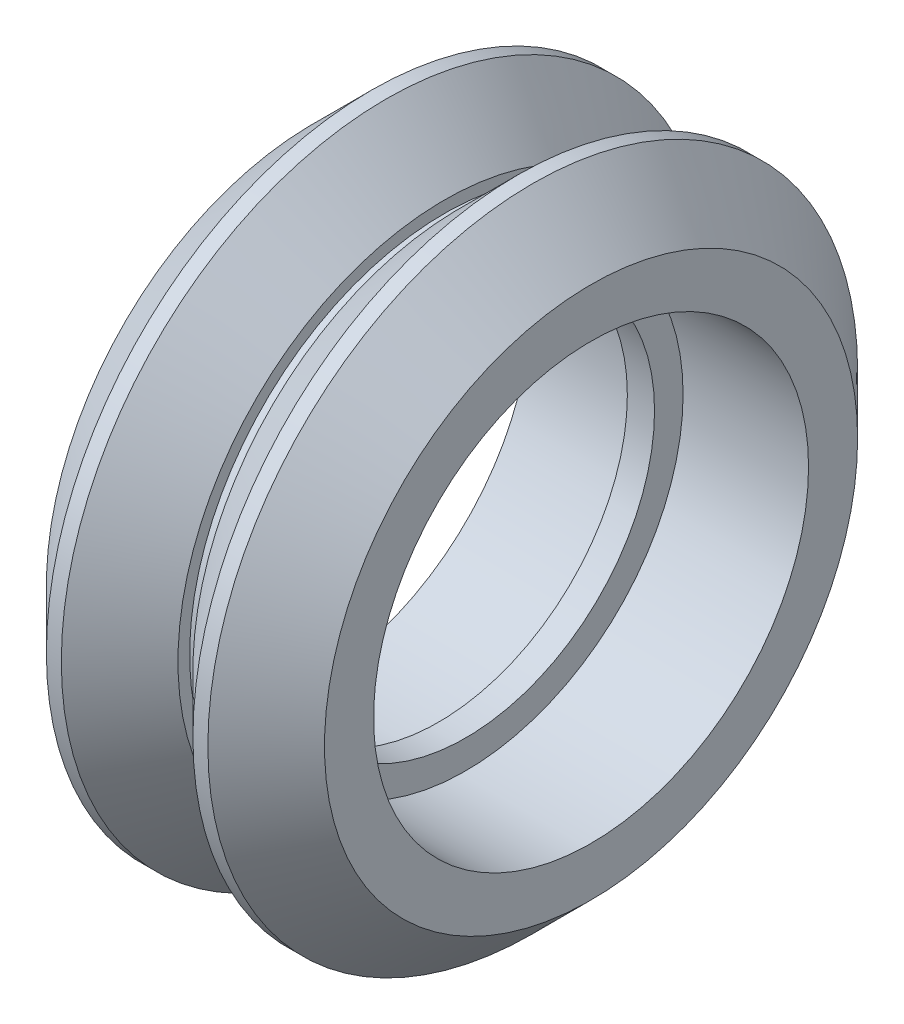
ISO-10303-21;
HEADER;
FILE_DESCRIPTION(('STEP AP214'),'2;1');
FILE_NAME('part.step','',(''),(''),'','','');
FILE_SCHEMA(('AUTOMOTIVE_DESIGN { 1 0 10303 214 1 1 1 1 }'));
ENDSEC;
DATA;
#1=APPLICATION_CONTEXT('core data for automotive mechanical design processes');
#2=APPLICATION_PROTOCOL_DEFINITION('international standard','automotive_design',2000,#1);
#3=PRODUCT_CONTEXT('',#1,'mechanical');
#4=PRODUCT('Part','Part','',(#3));
#5=PRODUCT_RELATED_PRODUCT_CATEGORY('part','',(#4));
#6=PRODUCT_DEFINITION_FORMATION('','',#4);
#7=PRODUCT_DEFINITION_CONTEXT('part definition',#1,'design');
#8=PRODUCT_DEFINITION('design','',#6,#7);
#9=PRODUCT_DEFINITION_SHAPE('','',#8);
#10=(LENGTH_UNIT() NAMED_UNIT(*) SI_UNIT(.MILLI.,.METRE.));
#11=(NAMED_UNIT(*) PLANE_ANGLE_UNIT() SI_UNIT($,.RADIAN.));
#12=(NAMED_UNIT(*) SI_UNIT($,.STERADIAN.) SOLID_ANGLE_UNIT());
#13=UNCERTAINTY_MEASURE_WITH_UNIT(LENGTH_MEASURE(1.E-05),#10,'distance_accuracy_value','');
#14=(GEOMETRIC_REPRESENTATION_CONTEXT(3) GLOBAL_UNCERTAINTY_ASSIGNED_CONTEXT((#13)) GLOBAL_UNIT_ASSIGNED_CONTEXT((#10,
#11,#12)) REPRESENTATION_CONTEXT('',''));
#15=CARTESIAN_POINT('',(0.,0.,0.));
#16=DIRECTION('',(0.,0.,1.));
#17=DIRECTION('',(1.,0.,0.));
#18=AXIS2_PLACEMENT_3D('',#15,#16,#17);
#19=CARTESIAN_POINT('',(-0.499999999999999,6.95,0.));
#20=DIRECTION('',(-1.,0.,0.));
#21=DIRECTION('',(0.,0.,1.));
#22=AXIS2_PLACEMENT_3D('',#19,#20,#21);
#23=PLANE('',#22);
#24=CARTESIAN_POINT('',(-0.499999999999999,0.,0.));
#25=DIRECTION('',(1.,0.,0.));
#26=DIRECTION('',(0.,0.,-1.));
#27=AXIS2_PLACEMENT_3D('',#24,#25,#26);
#28=CIRCLE('',#27,6.95);
#29=CARTESIAN_POINT('',(-0.499999999999999,0.,-6.95));
#30=VERTEX_POINT('',#29);
#31=EDGE_CURVE('E10',#30,#30,#28,.T.);
#32=ORIENTED_EDGE('',*,*,#31,.T.);
#33=EDGE_LOOP('',(#32));
#34=FACE_BOUND('',#33,.T.);
#35=CARTESIAN_POINT('',(-0.499999999999999,0.,0.));
#36=DIRECTION('',(1.,0.,0.));
#37=DIRECTION('',(0.,0.,-1.));
#38=AXIS2_PLACEMENT_3D('',#35,#36,#37);
#39=CIRCLE('',#38,8.);
#40=CARTESIAN_POINT('',(-0.499999999999999,0.,-8.));
#41=VERTEX_POINT('',#40);
#42=EDGE_CURVE('E85',#41,#41,#39,.T.);
#43=ORIENTED_EDGE('',*,*,#42,.F.);
#44=EDGE_LOOP('',(#43));
#45=FACE_BOUND('',#44,.T.);
#46=ADVANCED_FACE('F33',(#34,#45),#23,.T.);
#47=CARTESIAN_POINT('',(0.,0.,0.));
#48=DIRECTION('',(1.,0.,0.));
#49=DIRECTION('',(0.,0.,-1.));
#50=AXIS2_PLACEMENT_3D('',#47,#48,#49);
#51=CYLINDRICAL_SURFACE('',#50,6.95);
#52=CARTESIAN_POINT('',(0.500000000000001,0.,0.));
#53=DIRECTION('',(1.,0.,0.));
#54=DIRECTION('',(0.,0.,-1.));
#55=AXIS2_PLACEMENT_3D('',#52,#53,#54);
#56=CIRCLE('',#55,6.95);
#57=CARTESIAN_POINT('',(0.500000000000001,0.,-6.95));
#58=VERTEX_POINT('',#57);
#59=EDGE_CURVE('E39',#58,#58,#56,.T.);
#60=ORIENTED_EDGE('',*,*,#59,.T.);
#61=EDGE_LOOP('',(#60));
#62=FACE_BOUND('',#61,.T.);
#63=ORIENTED_EDGE('',*,*,#31,.F.);
#64=EDGE_LOOP('',(#63));
#65=FACE_BOUND('',#64,.T.);
#66=ADVANCED_FACE('F93',(#62,#65),#51,.F.);
#67=CARTESIAN_POINT('',(0.500000000000001,6.95,0.));
#68=DIRECTION('',(1.,0.,0.));
#69=DIRECTION('',(0.,0.,-1.));
#70=AXIS2_PLACEMENT_3D('',#67,#68,#69);
#71=PLANE('',#70);
#72=CARTESIAN_POINT('',(0.5,0.,0.));
#73=DIRECTION('',(1.,0.,0.));
#74=DIRECTION('',(0.,0.,-1.));
#75=AXIS2_PLACEMENT_3D('',#72,#73,#74);
#76=CIRCLE('',#75,8.);
#77=CARTESIAN_POINT('',(0.5,0.,-8.));
#78=VERTEX_POINT('',#77);
#79=EDGE_CURVE('E43',#78,#78,#76,.T.);
#80=ORIENTED_EDGE('',*,*,#79,.T.);
#81=EDGE_LOOP('',(#80));
#82=FACE_BOUND('',#81,.T.);
#83=ORIENTED_EDGE('',*,*,#59,.F.);
#84=EDGE_LOOP('',(#83));
#85=FACE_BOUND('',#84,.T.);
#86=ADVANCED_FACE('F97',(#82,#85),#71,.T.);
#87=CARTESIAN_POINT('',(0.,0.,0.));
#88=DIRECTION('',(1.,0.,0.));
#89=DIRECTION('',(0.,0.,-1.));
#90=AXIS2_PLACEMENT_3D('',#87,#88,#89);
#91=CYLINDRICAL_SURFACE('',#90,8.);
#92=CARTESIAN_POINT('',(5.115,0.,0.));
#93=DIRECTION('',(1.,0.,0.));
#94=DIRECTION('',(0.,0.,-1.));
#95=AXIS2_PLACEMENT_3D('',#92,#93,#94);
#96=CIRCLE('',#95,8.);
#97=CARTESIAN_POINT('',(5.115,0.,-8.));
#98=VERTEX_POINT('',#97);
#99=EDGE_CURVE('E47',#98,#98,#96,.T.);
#100=ORIENTED_EDGE('',*,*,#99,.T.);
#101=EDGE_LOOP('',(#100));
#102=FACE_BOUND('',#101,.T.);
#103=ORIENTED_EDGE('',*,*,#79,.F.);
#104=EDGE_LOOP('',(#103));
#105=FACE_BOUND('',#104,.T.);
#106=ADVANCED_FACE('F101',(#102,#105),#91,.F.);
#107=CARTESIAN_POINT('',(5.115,8.,0.));
#108=DIRECTION('',(1.,0.,0.));
#109=DIRECTION('',(0.,0.,-1.));
#110=AXIS2_PLACEMENT_3D('',#107,#108,#109);
#111=PLANE('',#110);
#112=CARTESIAN_POINT('',(5.115,0.,0.));
#113=DIRECTION('',(1.,0.,0.));
#114=DIRECTION('',(0.,0.,-1.));
#115=AXIS2_PLACEMENT_3D('',#112,#113,#114);
#116=CIRCLE('',#115,9.805);
#117=CARTESIAN_POINT('',(5.115,0.,-9.805));
#118=VERTEX_POINT('',#117);
#119=EDGE_CURVE('E52',#118,#118,#116,.T.);
#120=ORIENTED_EDGE('',*,*,#119,.T.);
#121=EDGE_LOOP('',(#120));
#122=FACE_BOUND('',#121,.T.);
#123=ORIENTED_EDGE('',*,*,#99,.F.);
#124=EDGE_LOOP('',(#123));
#125=FACE_BOUND('',#124,.T.);
#126=ADVANCED_FACE('F108',(#122,#125),#111,.T.);
#127=CARTESIAN_POINT('',(5.115,0.,0.));
#128=DIRECTION('',(-1.,0.,0.));
#129=DIRECTION('',(0.,0.,1.));
#130=AXIS2_PLACEMENT_3D('',#127,#128,#129);
#131=CONICAL_SURFACE('',#130,9.805,0.785398163397447);
#132=CARTESIAN_POINT('',(2.96999999999999,0.,0.));
#133=DIRECTION('',(1.,0.,0.));
#134=DIRECTION('',(0.,0.,-1.));
#135=AXIS2_PLACEMENT_3D('',#132,#133,#134);
#136=CIRCLE('',#135,11.95);
#137=CARTESIAN_POINT('',(2.96999999999999,0.,-11.95));
#138=VERTEX_POINT('',#137);
#139=EDGE_CURVE('E55',#138,#138,#136,.T.);
#140=ORIENTED_EDGE('',*,*,#139,.T.);
#141=EDGE_LOOP('',(#140));
#142=FACE_BOUND('',#141,.T.);
#143=ORIENTED_EDGE('',*,*,#119,.F.);
#144=EDGE_LOOP('',(#143));
#145=FACE_BOUND('',#144,.T.);
#146=ADVANCED_FACE('F112',(#142,#145),#131,.T.);
#147=CARTESIAN_POINT('',(0.,0.,0.));
#148=DIRECTION('',(1.,0.,0.));
#149=DIRECTION('',(0.,0.,-1.));
#150=AXIS2_PLACEMENT_3D('',#147,#148,#149);
#151=CYLINDRICAL_SURFACE('',#150,11.95);
#152=CARTESIAN_POINT('',(2.41999999999999,0.,0.));
#153=DIRECTION('',(1.,0.,0.));
#154=DIRECTION('',(0.,0.,-1.));
#155=AXIS2_PLACEMENT_3D('',#152,#153,#154);
#156=CIRCLE('',#155,11.95);
#157=CARTESIAN_POINT('',(2.41999999999999,0.,-11.95));
#158=VERTEX_POINT('',#157);
#159=EDGE_CURVE('E58',#158,#158,#156,.T.);
#160=ORIENTED_EDGE('',*,*,#159,.T.);
#161=EDGE_LOOP('',(#160));
#162=FACE_BOUND('',#161,.T.);
#163=ORIENTED_EDGE('',*,*,#139,.F.);
#164=EDGE_LOOP('',(#163));
#165=FACE_BOUND('',#164,.T.);
#166=ADVANCED_FACE('F116',(#162,#165),#151,.T.);
#167=CARTESIAN_POINT('',(2.41999999999999,0.,0.));
#168=DIRECTION('',(1.,0.,0.));
#169=DIRECTION('',(0.,0.,-1.));
#170=AXIS2_PLACEMENT_3D('',#167,#168,#169);
#171=CONICAL_SURFACE('',#170,11.95,0.78539816339745);
#172=CARTESIAN_POINT('',(0.275000000000002,0.,0.));
#173=DIRECTION('',(1.,0.,0.));
#174=DIRECTION('',(0.,0.,-1.));
#175=AXIS2_PLACEMENT_3D('',#172,#173,#174);
#176=CIRCLE('',#175,9.805);
#177=CARTESIAN_POINT('',(0.275000000000002,0.,-9.805));
#178=VERTEX_POINT('',#177);
#179=EDGE_CURVE('E61',#178,#178,#176,.T.);
#180=ORIENTED_EDGE('',*,*,#179,.T.);
#181=EDGE_LOOP('',(#180));
#182=FACE_BOUND('',#181,.T.);
#183=ORIENTED_EDGE('',*,*,#159,.F.);
#184=EDGE_LOOP('',(#183));
#185=FACE_BOUND('',#184,.T.);
#186=ADVANCED_FACE('F120',(#182,#185),#171,.T.);
#187=CARTESIAN_POINT('',(0.275,9.805,0.));
#188=DIRECTION('',(-1.,0.,0.));
#189=DIRECTION('',(0.,0.,1.));
#190=AXIS2_PLACEMENT_3D('',#187,#188,#189);
#191=PLANE('',#190);
#192=CARTESIAN_POINT('',(0.274999999999999,0.,0.));
#193=DIRECTION('',(1.,0.,0.));
#194=DIRECTION('',(0.,0.,-1.));
#195=AXIS2_PLACEMENT_3D('',#192,#193,#194);
#196=CIRCLE('',#195,9.375);
#197=CARTESIAN_POINT('',(0.274999999999999,0.,-9.375));
#198=VERTEX_POINT('',#197);
#199=EDGE_CURVE('E64',#198,#198,#196,.T.);
#200=ORIENTED_EDGE('',*,*,#199,.T.);
#201=EDGE_LOOP('',(#200));
#202=FACE_BOUND('',#201,.T.);
#203=ORIENTED_EDGE('',*,*,#179,.F.);
#204=EDGE_LOOP('',(#203));
#205=FACE_BOUND('',#204,.T.);
#206=ADVANCED_FACE('F124',(#202,#205),#191,.T.);
#207=CARTESIAN_POINT('',(0.,0.,0.));
#208=DIRECTION('',(1.,0.,0.));
#209=DIRECTION('',(0.,0.,-1.));
#210=AXIS2_PLACEMENT_3D('',#207,#208,#209);
#211=CYLINDRICAL_SURFACE('',#210,9.375);
#212=CARTESIAN_POINT('',(-0.275000000000001,0.,0.));
#213=DIRECTION('',(1.,0.,0.));
#214=DIRECTION('',(0.,0.,-1.));
#215=AXIS2_PLACEMENT_3D('',#212,#213,#214);
#216=CIRCLE('',#215,9.375);
#217=CARTESIAN_POINT('',(-0.275000000000001,0.,-9.375));
#218=VERTEX_POINT('',#217);
#219=EDGE_CURVE('E67',#218,#218,#216,.T.);
#220=ORIENTED_EDGE('',*,*,#219,.T.);
#221=EDGE_LOOP('',(#220));
#222=FACE_BOUND('',#221,.T.);
#223=ORIENTED_EDGE('',*,*,#199,.F.);
#224=EDGE_LOOP('',(#223));
#225=FACE_BOUND('',#224,.T.);
#226=ADVANCED_FACE('F128',(#222,#225),#211,.T.);
#227=CARTESIAN_POINT('',(-0.275000000000001,9.805,0.));
#228=DIRECTION('',(1.,0.,0.));
#229=DIRECTION('',(0.,0.,-1.));
#230=AXIS2_PLACEMENT_3D('',#227,#228,#229);
#231=PLANE('',#230);
#232=CARTESIAN_POINT('',(-0.275000000000001,0.,0.));
#233=DIRECTION('',(1.,0.,0.));
#234=DIRECTION('',(0.,0.,-1.));
#235=AXIS2_PLACEMENT_3D('',#232,#233,#234);
#236=CIRCLE('',#235,9.805);
#237=CARTESIAN_POINT('',(-0.275000000000001,0.,-9.805));
#238=VERTEX_POINT('',#237);
#239=EDGE_CURVE('E70',#238,#238,#236,.T.);
#240=ORIENTED_EDGE('',*,*,#239,.T.);
#241=EDGE_LOOP('',(#240));
#242=FACE_BOUND('',#241,.T.);
#243=ORIENTED_EDGE('',*,*,#219,.F.);
#244=EDGE_LOOP('',(#243));
#245=FACE_BOUND('',#244,.T.);
#246=ADVANCED_FACE('F132',(#242,#245),#231,.T.);
#247=CARTESIAN_POINT('',(-0.275000000000001,0.,0.));
#248=DIRECTION('',(-1.,0.,0.));
#249=DIRECTION('',(0.,0.,1.));
#250=AXIS2_PLACEMENT_3D('',#247,#248,#249);
#251=CONICAL_SURFACE('',#250,9.805,0.78539816339745);
#252=CARTESIAN_POINT('',(-2.41999999999999,0.,0.));
#253=DIRECTION('',(1.,0.,0.));
#254=DIRECTION('',(0.,0.,-1.));
#255=AXIS2_PLACEMENT_3D('',#252,#253,#254);
#256=CIRCLE('',#255,11.95);
#257=CARTESIAN_POINT('',(-2.41999999999999,0.,-11.95));
#258=VERTEX_POINT('',#257);
#259=EDGE_CURVE('E73',#258,#258,#256,.T.);
#260=ORIENTED_EDGE('',*,*,#259,.T.);
#261=EDGE_LOOP('',(#260));
#262=FACE_BOUND('',#261,.T.);
#263=ORIENTED_EDGE('',*,*,#239,.F.);
#264=EDGE_LOOP('',(#263));
#265=FACE_BOUND('',#264,.T.);
#266=ADVANCED_FACE('F136',(#262,#265),#251,.T.);
#267=CARTESIAN_POINT('',(0.,0.,0.));
#268=DIRECTION('',(1.,0.,0.));
#269=DIRECTION('',(0.,0.,-1.));
#270=AXIS2_PLACEMENT_3D('',#267,#268,#269);
#271=CYLINDRICAL_SURFACE('',#270,11.95);
#272=CARTESIAN_POINT('',(-2.96999999999999,0.,0.));
#273=DIRECTION('',(1.,0.,0.));
#274=DIRECTION('',(0.,0.,-1.));
#275=AXIS2_PLACEMENT_3D('',#272,#273,#274);
#276=CIRCLE('',#275,11.95);
#277=CARTESIAN_POINT('',(-2.96999999999999,0.,-11.95));
#278=VERTEX_POINT('',#277);
#279=EDGE_CURVE('E76',#278,#278,#276,.T.);
#280=ORIENTED_EDGE('',*,*,#279,.T.);
#281=EDGE_LOOP('',(#280));
#282=FACE_BOUND('',#281,.T.);
#283=ORIENTED_EDGE('',*,*,#259,.F.);
#284=EDGE_LOOP('',(#283));
#285=FACE_BOUND('',#284,.T.);
#286=ADVANCED_FACE('F140',(#282,#285),#271,.T.);
#287=CARTESIAN_POINT('',(-2.96999999999999,0.,0.));
#288=DIRECTION('',(1.,0.,0.));
#289=DIRECTION('',(0.,0.,-1.));
#290=AXIS2_PLACEMENT_3D('',#287,#288,#289);
#291=CONICAL_SURFACE('',#290,11.95,0.785398163397447);
#292=CARTESIAN_POINT('',(-5.115,0.,0.));
#293=DIRECTION('',(1.,0.,0.));
#294=DIRECTION('',(0.,0.,-1.));
#295=AXIS2_PLACEMENT_3D('',#292,#293,#294);
#296=CIRCLE('',#295,9.805);
#297=CARTESIAN_POINT('',(-5.115,0.,-9.805));
#298=VERTEX_POINT('',#297);
#299=EDGE_CURVE('E79',#298,#298,#296,.T.);
#300=ORIENTED_EDGE('',*,*,#299,.T.);
#301=EDGE_LOOP('',(#300));
#302=FACE_BOUND('',#301,.T.);
#303=ORIENTED_EDGE('',*,*,#279,.F.);
#304=EDGE_LOOP('',(#303));
#305=FACE_BOUND('',#304,.T.);
#306=ADVANCED_FACE('F144',(#302,#305),#291,.T.);
#307=CARTESIAN_POINT('',(-5.115,8.,0.));
#308=DIRECTION('',(-1.,0.,0.));
#309=DIRECTION('',(0.,0.,1.));
#310=AXIS2_PLACEMENT_3D('',#307,#308,#309);
#311=PLANE('',#310);
#312=CARTESIAN_POINT('',(-5.115,0.,0.));
#313=DIRECTION('',(1.,0.,0.));
#314=DIRECTION('',(0.,0.,-1.));
#315=AXIS2_PLACEMENT_3D('',#312,#313,#314);
#316=CIRCLE('',#315,8.);
#317=CARTESIAN_POINT('',(-5.115,0.,-8.));
#318=VERTEX_POINT('',#317);
#319=EDGE_CURVE('E82',#318,#318,#316,.T.);
#320=ORIENTED_EDGE('',*,*,#319,.T.);
#321=EDGE_LOOP('',(#320));
#322=FACE_BOUND('',#321,.T.);
#323=ORIENTED_EDGE('',*,*,#299,.F.);
#324=EDGE_LOOP('',(#323));
#325=FACE_BOUND('',#324,.T.);
#326=ADVANCED_FACE('F148',(#322,#325),#311,.T.);
#327=CARTESIAN_POINT('',(0.,0.,0.));
#328=DIRECTION('',(1.,0.,0.));
#329=DIRECTION('',(0.,0.,-1.));
#330=AXIS2_PLACEMENT_3D('',#327,#328,#329);
#331=CYLINDRICAL_SURFACE('',#330,8.);
#332=ORIENTED_EDGE('',*,*,#42,.T.);
#333=EDGE_LOOP('',(#332));
#334=FACE_BOUND('',#333,.T.);
#335=ORIENTED_EDGE('',*,*,#319,.F.);
#336=EDGE_LOOP('',(#335));
#337=FACE_BOUND('',#336,.T.);
#338=ADVANCED_FACE('F89',(#334,#337),#331,.F.);
#339=CLOSED_SHELL('',(#46,#66,#86,#106,#126,#146,#166,#186,#206,#226,#246,#266,#286,#306,#326,#338));
#340=MANIFOLD_SOLID_BREP('B2',#339);
#341=ADVANCED_BREP_SHAPE_REPRESENTATION('',(#18,#340),#14);
#342=SHAPE_DEFINITION_REPRESENTATION(#9,#341);
ENDSEC;
END-ISO-10303-21;
